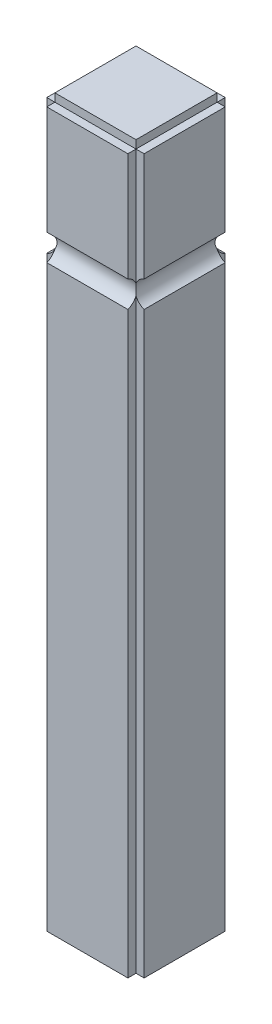
ISO-10303-21;
HEADER;
FILE_DESCRIPTION(('STEP AP214'),'2;1');
FILE_NAME('part.step','',(''),(''),'','','');
FILE_SCHEMA(('AUTOMOTIVE_DESIGN { 1 0 10303 214 1 1 1 1 }'));
ENDSEC;
DATA;
#1=APPLICATION_CONTEXT('core data for automotive mechanical design processes');
#2=APPLICATION_PROTOCOL_DEFINITION('international standard','automotive_design',2000,#1);
#3=PRODUCT_CONTEXT('',#1,'mechanical');
#4=PRODUCT('Part','Part','',(#3));
#5=PRODUCT_RELATED_PRODUCT_CATEGORY('part','',(#4));
#6=PRODUCT_DEFINITION_FORMATION('','',#4);
#7=PRODUCT_DEFINITION_CONTEXT('part definition',#1,'design');
#8=PRODUCT_DEFINITION('design','',#6,#7);
#9=PRODUCT_DEFINITION_SHAPE('','',#8);
#10=(LENGTH_UNIT() NAMED_UNIT(*) SI_UNIT(.MILLI.,.METRE.));
#11=(NAMED_UNIT(*) PLANE_ANGLE_UNIT() SI_UNIT($,.RADIAN.));
#12=(NAMED_UNIT(*) SI_UNIT($,.STERADIAN.) SOLID_ANGLE_UNIT());
#13=UNCERTAINTY_MEASURE_WITH_UNIT(LENGTH_MEASURE(1.E-05),#10,'distance_accuracy_value','');
#14=(GEOMETRIC_REPRESENTATION_CONTEXT(3) GLOBAL_UNCERTAINTY_ASSIGNED_CONTEXT((#13)) GLOBAL_UNIT_ASSIGNED_CONTEXT((#10,
#11,#12)) REPRESENTATION_CONTEXT('',''));
#15=CARTESIAN_POINT('',(0.,0.,0.));
#16=DIRECTION('',(0.,0.,1.));
#17=DIRECTION('',(1.,0.,0.));
#18=AXIS2_PLACEMENT_3D('',#15,#16,#17);
#19=CARTESIAN_POINT('',(0.,0.,0.));
#20=DIRECTION('',(0.,-1.,0.));
#21=DIRECTION('',(0.,0.,-1.));
#22=AXIS2_PLACEMENT_3D('',#19,#20,#21);
#23=PLANE('',#22);
#24=DIRECTION('',(0.,0.,1.));
#25=VECTOR('',#24,1.);
#26=CARTESIAN_POINT('',(15.,0.,-165.));
#27=LINE('',#26,#25);
#28=CARTESIAN_POINT('',(15.,0.,-165.));
#29=VERTEX_POINT('',#28);
#30=CARTESIAN_POINT('',(15.,0.,-15.));
#31=VERTEX_POINT('',#30);
#32=EDGE_CURVE('E243',#29,#31,#27,.T.);
#33=ORIENTED_EDGE('',*,*,#32,.F.);
#34=DIRECTION('',(1.,0.,0.));
#35=VECTOR('',#34,1.);
#36=CARTESIAN_POINT('',(0.,0.,-165.));
#37=LINE('',#36,#35);
#38=CARTESIAN_POINT('',(0.,0.,-165.));
#39=VERTEX_POINT('',#38);
#40=EDGE_CURVE('E390',#39,#29,#37,.T.);
#41=ORIENTED_EDGE('',*,*,#40,.F.);
#42=DIRECTION('',(0.,0.,1.));
#43=VECTOR('',#42,1.);
#44=CARTESIAN_POINT('',(0.,0.,0.));
#45=LINE('',#44,#43);
#46=CARTESIAN_POINT('',(0.,0.,-15.));
#47=VERTEX_POINT('',#46);
#48=EDGE_CURVE('E448',#39,#47,#45,.T.);
#49=ORIENTED_EDGE('',*,*,#48,.T.);
#50=DIRECTION('',(-1.,0.,0.));
#51=VECTOR('',#50,1.);
#52=CARTESIAN_POINT('',(0.,0.,-15.));
#53=LINE('',#52,#51);
#54=EDGE_CURVE('E373',#31,#47,#53,.T.);
#55=ORIENTED_EDGE('',*,*,#54,.F.);
#56=EDGE_LOOP('',(#33,#41,#49,#55));
#57=FACE_BOUND('',#56,.T.);
#58=ADVANCED_FACE('F39',(#57),#23,.F.);
#59=DIRECTION('',(-1.,0.,0.));
#60=VECTOR('',#59,1.);
#61=CARTESIAN_POINT('',(165.,0.,-165.));
#62=LINE('',#61,#60);
#63=CARTESIAN_POINT('',(165.,0.,-165.));
#64=VERTEX_POINT('',#63);
#65=EDGE_CURVE('E240',#64,#29,#62,.T.);
#66=ORIENTED_EDGE('',*,*,#65,.F.);
#67=DIRECTION('',(0.,0.,1.));
#68=VECTOR('',#67,1.);
#69=CARTESIAN_POINT('',(165.,0.,-180.));
#70=LINE('',#69,#68);
#71=CARTESIAN_POINT('',(165.,0.,-180.));
#72=VERTEX_POINT('',#71);
#73=EDGE_CURVE('E357',#72,#64,#70,.T.);
#74=ORIENTED_EDGE('',*,*,#73,.F.);
#75=DIRECTION('',(-1.,0.,0.));
#76=VECTOR('',#75,1.);
#77=CARTESIAN_POINT('',(0.,0.,-180.));
#78=LINE('',#77,#76);
#79=CARTESIAN_POINT('',(15.,0.,-180.));
#80=VERTEX_POINT('',#79);
#81=EDGE_CURVE('E464',#72,#80,#78,.T.);
#82=ORIENTED_EDGE('',*,*,#81,.T.);
#83=DIRECTION('',(0.,0.,-1.));
#84=VECTOR('',#83,1.);
#85=CARTESIAN_POINT('',(15.,0.,-180.));
#86=LINE('',#85,#84);
#87=EDGE_CURVE('E433',#29,#80,#86,.T.);
#88=ORIENTED_EDGE('',*,*,#87,.F.);
#89=EDGE_LOOP('',(#66,#74,#82,#88));
#90=FACE_BOUND('',#89,.T.);
#91=ADVANCED_FACE('F596',(#90),#23,.F.);
#92=DIRECTION('',(0.,0.,-1.));
#93=VECTOR('',#92,1.);
#94=CARTESIAN_POINT('',(165.,0.,-15.));
#95=LINE('',#94,#93);
#96=CARTESIAN_POINT('',(165.,0.,-15.));
#97=VERTEX_POINT('',#96);
#98=EDGE_CURVE('E552',#97,#64,#95,.T.);
#99=ORIENTED_EDGE('',*,*,#98,.F.);
#100=DIRECTION('',(-1.,0.,0.));
#101=VECTOR('',#100,1.);
#102=CARTESIAN_POINT('',(180.,0.,-15.));
#103=LINE('',#102,#101);
#104=CARTESIAN_POINT('',(180.,0.,-15.));
#105=VERTEX_POINT('',#104);
#106=EDGE_CURVE('E347',#105,#97,#103,.T.);
#107=ORIENTED_EDGE('',*,*,#106,.F.);
#108=DIRECTION('',(0.,0.,-1.));
#109=VECTOR('',#108,1.);
#110=CARTESIAN_POINT('',(180.,0.,0.));
#111=LINE('',#110,#109);
#112=CARTESIAN_POINT('',(180.,0.,-165.));
#113=VERTEX_POINT('',#112);
#114=EDGE_CURVE('E483',#105,#113,#111,.T.);
#115=ORIENTED_EDGE('',*,*,#114,.T.);
#116=DIRECTION('',(1.,0.,0.));
#117=VECTOR('',#116,1.);
#118=CARTESIAN_POINT('',(180.,0.,-165.));
#119=LINE('',#118,#117);
#120=EDGE_CURVE('E406',#64,#113,#119,.T.);
#121=ORIENTED_EDGE('',*,*,#120,.F.);
#122=EDGE_LOOP('',(#99,#107,#115,#121));
#123=FACE_BOUND('',#122,.T.);
#124=ADVANCED_FACE('F550',(#123),#23,.F.);
#125=DIRECTION('',(1.,0.,0.));
#126=VECTOR('',#125,1.);
#127=CARTESIAN_POINT('',(15.,0.,-15.));
#128=LINE('',#127,#126);
#129=EDGE_CURVE('E563',#31,#97,#128,.T.);
#130=ORIENTED_EDGE('',*,*,#129,.F.);
#131=DIRECTION('',(0.,0.,-1.));
#132=VECTOR('',#131,1.);
#133=CARTESIAN_POINT('',(15.,0.,0.));
#134=LINE('',#133,#132);
#135=CARTESIAN_POINT('',(15.,0.,0.));
#136=VERTEX_POINT('',#135);
#137=EDGE_CURVE('E378',#136,#31,#134,.T.);
#138=ORIENTED_EDGE('',*,*,#137,.F.);
#139=DIRECTION('',(1.,0.,0.));
#140=VECTOR('',#139,1.);
#141=CARTESIAN_POINT('',(0.,0.,0.));
#142=LINE('',#141,#140);
#143=CARTESIAN_POINT('',(165.,0.,0.));
#144=VERTEX_POINT('',#143);
#145=EDGE_CURVE('E479',#136,#144,#142,.T.);
#146=ORIENTED_EDGE('',*,*,#145,.T.);
#147=DIRECTION('',(0.,0.,1.));
#148=VECTOR('',#147,1.);
#149=CARTESIAN_POINT('',(165.,0.,0.));
#150=LINE('',#149,#148);
#151=EDGE_CURVE('E343',#97,#144,#150,.T.);
#152=ORIENTED_EDGE('',*,*,#151,.F.);
#153=EDGE_LOOP('',(#130,#138,#146,#152));
#154=FACE_BOUND('',#153,.T.);
#155=ADVANCED_FACE('F562',(#154),#23,.F.);
#156=CARTESIAN_POINT('',(0.,-1320.,-180.));
#157=DIRECTION('',(0.,0.,-1.));
#158=DIRECTION('',(-1.,0.,0.));
#159=AXIS2_PLACEMENT_3D('',#156,#157,#158);
#160=PLANE('',#159);
#161=DIRECTION('',(-1.,0.,0.));
#162=VECTOR('',#161,1.);
#163=CARTESIAN_POINT('',(180.,-249.392621835301,-180.));
#164=LINE('',#163,#162);
#165=CARTESIAN_POINT('',(165.,-249.392621835301,-180.));
#166=VERTEX_POINT('',#165);
#167=CARTESIAN_POINT('',(15.0000000000001,-249.392621835301,-180.));
#168=VERTEX_POINT('',#167);
#169=EDGE_CURVE('E256',#166,#168,#164,.T.);
#170=ORIENTED_EDGE('',*,*,#169,.F.);
#171=DIRECTION('',(0.,1.,0.));
#172=VECTOR('',#171,1.);
#173=CARTESIAN_POINT('',(165.,-1320.,-180.));
#174=LINE('',#173,#172);
#175=CARTESIAN_POINT('',(165.,-1320.,-180.));
#176=VERTEX_POINT('',#175);
#177=EDGE_CURVE('E424',#176,#166,#174,.T.);
#178=ORIENTED_EDGE('',*,*,#177,.F.);
#179=DIRECTION('',(-1.,0.,0.));
#180=VECTOR('',#179,1.);
#181=CARTESIAN_POINT('',(0.,-1320.,-180.));
#182=LINE('',#181,#180);
#183=CARTESIAN_POINT('',(15.,-1320.,-180.));
#184=VERTEX_POINT('',#183);
#185=EDGE_CURVE('E472',#176,#184,#182,.T.);
#186=ORIENTED_EDGE('',*,*,#185,.T.);
#187=DIRECTION('',(0.,1.,0.));
#188=VECTOR('',#187,1.);
#189=CARTESIAN_POINT('',(15.,-1320.,-180.));
#190=LINE('',#189,#188);
#191=EDGE_CURVE('E444',#184,#168,#190,.T.);
#192=ORIENTED_EDGE('',*,*,#191,.T.);
#193=EDGE_LOOP('',(#170,#178,#186,#192));
#194=FACE_BOUND('',#193,.T.);
#195=ADVANCED_FACE('F606',(#194),#160,.T.);
#196=CARTESIAN_POINT('',(0.,-1320.,0.));
#197=DIRECTION('',(0.,0.,1.));
#198=DIRECTION('',(1.,0.,0.));
#199=AXIS2_PLACEMENT_3D('',#196,#197,#198);
#200=PLANE('',#199);
#201=DIRECTION('',(-1.,0.,0.));
#202=VECTOR('',#201,1.);
#203=CARTESIAN_POINT('',(180.,-200.607378164699,0.));
#204=LINE('',#203,#202);
#205=CARTESIAN_POINT('',(165.,-200.607378164699,0.));
#206=VERTEX_POINT('',#205);
#207=CARTESIAN_POINT('',(15.,-200.607378164699,0.));
#208=VERTEX_POINT('',#207);
#209=EDGE_CURVE('E250',#206,#208,#204,.T.);
#210=ORIENTED_EDGE('',*,*,#209,.F.);
#211=DIRECTION('',(0.,1.,0.));
#212=VECTOR('',#211,1.);
#213=CARTESIAN_POINT('',(165.,-1320.,0.));
#214=LINE('',#213,#212);
#215=EDGE_CURVE('E358',#206,#144,#214,.T.);
#216=ORIENTED_EDGE('',*,*,#215,.T.);
#217=ORIENTED_EDGE('',*,*,#145,.F.);
#218=DIRECTION('',(0.,1.,0.));
#219=VECTOR('',#218,1.);
#220=CARTESIAN_POINT('',(15.,-1320.,0.));
#221=LINE('',#220,#219);
#222=EDGE_CURVE('E377',#208,#136,#221,.T.);
#223=ORIENTED_EDGE('',*,*,#222,.F.);
#224=EDGE_LOOP('',(#210,#216,#217,#223));
#225=FACE_BOUND('',#224,.T.);
#226=ADVANCED_FACE('F559',(#225),#200,.T.);
#227=CARTESIAN_POINT('',(0.,-1320.,0.));
#228=DIRECTION('',(-1.,0.,0.));
#229=DIRECTION('',(0.,0.,1.));
#230=AXIS2_PLACEMENT_3D('',#227,#228,#229);
#231=PLANE('',#230);
#232=DIRECTION('',(0.,0.,1.));
#233=VECTOR('',#232,1.);
#234=CARTESIAN_POINT('',(0.,-249.392621835301,-180.));
#235=LINE('',#234,#233);
#236=CARTESIAN_POINT('',(0.,-249.392621835301,-165.));
#237=VERTEX_POINT('',#236);
#238=CARTESIAN_POINT('',(0.,-249.392621835301,-15.0000000000001));
#239=VERTEX_POINT('',#238);
#240=EDGE_CURVE('E309',#237,#239,#235,.T.);
#241=ORIENTED_EDGE('',*,*,#240,.F.);
#242=DIRECTION('',(0.,1.,0.));
#243=VECTOR('',#242,1.);
#244=CARTESIAN_POINT('',(0.,-1320.,-165.));
#245=LINE('',#244,#243);
#246=CARTESIAN_POINT('',(0.,-1320.,-165.));
#247=VERTEX_POINT('',#246);
#248=EDGE_CURVE('E455',#247,#237,#245,.T.);
#249=ORIENTED_EDGE('',*,*,#248,.F.);
#250=DIRECTION('',(0.,0.,1.));
#251=VECTOR('',#250,1.);
#252=CARTESIAN_POINT('',(0.,-1320.,0.));
#253=LINE('',#252,#251);
#254=CARTESIAN_POINT('',(0.,-1320.,-15.));
#255=VERTEX_POINT('',#254);
#256=EDGE_CURVE('E459',#247,#255,#253,.T.);
#257=ORIENTED_EDGE('',*,*,#256,.T.);
#258=DIRECTION('',(0.,1.,0.));
#259=VECTOR('',#258,1.);
#260=CARTESIAN_POINT('',(0.,-1320.,-15.));
#261=LINE('',#260,#259);
#262=EDGE_CURVE('E386',#255,#239,#261,.T.);
#263=ORIENTED_EDGE('',*,*,#262,.T.);
#264=EDGE_LOOP('',(#241,#249,#257,#263));
#265=FACE_BOUND('',#264,.T.);
#266=ADVANCED_FACE('F796',(#265),#231,.T.);
#267=CARTESIAN_POINT('',(180.,-1320.,0.));
#268=DIRECTION('',(1.,0.,0.));
#269=DIRECTION('',(0.,0.,-1.));
#270=AXIS2_PLACEMENT_3D('',#267,#268,#269);
#271=PLANE('',#270);
#272=DIRECTION('',(0.,0.,1.));
#273=VECTOR('',#272,1.);
#274=CARTESIAN_POINT('',(180.,-200.607378164699,-180.));
#275=LINE('',#274,#273);
#276=CARTESIAN_POINT('',(180.,-200.607378164699,-165.));
#277=VERTEX_POINT('',#276);
#278=CARTESIAN_POINT('',(180.,-200.607378164699,-15.));
#279=VERTEX_POINT('',#278);
#280=EDGE_CURVE('E310',#277,#279,#275,.T.);
#281=ORIENTED_EDGE('',*,*,#280,.F.);
#282=DIRECTION('',(0.,1.,0.));
#283=VECTOR('',#282,1.);
#284=CARTESIAN_POINT('',(180.,-1320.,-165.));
#285=LINE('',#284,#283);
#286=EDGE_CURVE('E418',#277,#113,#285,.T.);
#287=ORIENTED_EDGE('',*,*,#286,.T.);
#288=ORIENTED_EDGE('',*,*,#114,.F.);
#289=DIRECTION('',(0.,1.,0.));
#290=VECTOR('',#289,1.);
#291=CARTESIAN_POINT('',(180.,-1320.,-15.));
#292=LINE('',#291,#290);
#293=EDGE_CURVE('E63',#279,#105,#292,.T.);
#294=ORIENTED_EDGE('',*,*,#293,.F.);
#295=EDGE_LOOP('',(#281,#287,#288,#294));
#296=FACE_BOUND('',#295,.T.);
#297=ADVANCED_FACE('F545',(#296),#271,.T.);
#298=CARTESIAN_POINT('',(15.,-1320.,-180.));
#299=DIRECTION('',(1.,0.,0.));
#300=DIRECTION('',(0.,0.,-1.));
#301=AXIS2_PLACEMENT_3D('',#298,#299,#300);
#302=PLANE('',#301);
#303=CARTESIAN_POINT('',(15.0000000000001,-200.607378164699,-180.));
#304=VERTEX_POINT('',#303);
#305=EDGE_CURVE('E449',#304,#80,#190,.T.);
#306=ORIENTED_EDGE('',*,*,#305,.F.);
#307=CARTESIAN_POINT('',(15.,-225.,-189.));
#308=DIRECTION('',(1.,0.,0.));
#309=DIRECTION('',(0.,0.,-1.));
#310=AXIS2_PLACEMENT_3D('',#307,#308,#309);
#311=CIRCLE('',#310,26.);
#312=CARTESIAN_POINT('',(15.,-215.,-165.));
#313=VERTEX_POINT('',#312);
#314=EDGE_CURVE('E300',#304,#313,#311,.T.);
#315=ORIENTED_EDGE('',*,*,#314,.T.);
#316=DIRECTION('',(0.,1.,0.));
#317=VECTOR('',#316,1.);
#318=CARTESIAN_POINT('',(15.,-1320.,-165.));
#319=LINE('',#318,#317);
#320=EDGE_CURVE('E454',#313,#29,#319,.T.);
#321=ORIENTED_EDGE('',*,*,#320,.T.);
#322=ORIENTED_EDGE('',*,*,#87,.T.);
#323=EDGE_LOOP('',(#306,#315,#321,#322));
#324=FACE_BOUND('',#323,.T.);
#325=ADVANCED_FACE('F736',(#324),#302,.F.);
#326=CARTESIAN_POINT('',(0.,-1320.,-165.));
#327=DIRECTION('',(0.,0.,1.));
#328=DIRECTION('',(1.,0.,0.));
#329=AXIS2_PLACEMENT_3D('',#326,#327,#328);
#330=PLANE('',#329);
#331=ORIENTED_EDGE('',*,*,#320,.F.);
#332=CARTESIAN_POINT('',(-9.,-225.,-165.));
#333=DIRECTION('',(0.,0.,1.));
#334=DIRECTION('',(1.,0.,0.));
#335=AXIS2_PLACEMENT_3D('',#332,#333,#334);
#336=CIRCLE('',#335,26.);
#337=CARTESIAN_POINT('',(0.,-200.607378164699,-165.));
#338=VERTEX_POINT('',#337);
#339=EDGE_CURVE('E327',#313,#338,#336,.T.);
#340=ORIENTED_EDGE('',*,*,#339,.T.);
#341=EDGE_CURVE('E437',#338,#39,#245,.T.);
#342=ORIENTED_EDGE('',*,*,#341,.T.);
#343=ORIENTED_EDGE('',*,*,#40,.T.);
#344=EDGE_LOOP('',(#331,#340,#342,#343));
#345=FACE_BOUND('',#344,.T.);
#346=ADVANCED_FACE('F726',(#345),#330,.F.);
#347=CARTESIAN_POINT('',(165.,-1320.,0.));
#348=DIRECTION('',(-1.,0.,0.));
#349=DIRECTION('',(0.,0.,1.));
#350=AXIS2_PLACEMENT_3D('',#347,#348,#349);
#351=PLANE('',#350);
#352=DIRECTION('',(0.,1.,0.));
#353=VECTOR('',#352,1.);
#354=CARTESIAN_POINT('',(165.,-1320.,-15.));
#355=LINE('',#354,#353);
#356=CARTESIAN_POINT('',(165.,-1320.,-15.));
#357=VERTEX_POINT('',#356);
#358=CARTESIAN_POINT('',(165.,-235.,-15.));
#359=VERTEX_POINT('',#358);
#360=EDGE_CURVE('E359',#357,#359,#355,.T.);
#361=ORIENTED_EDGE('',*,*,#360,.T.);
#362=CARTESIAN_POINT('',(165.,-225.,9.));
#363=DIRECTION('',(-1.,0.,0.));
#364=DIRECTION('',(0.,0.,1.));
#365=AXIS2_PLACEMENT_3D('',#362,#363,#364);
#366=CIRCLE('',#365,26.);
#367=CARTESIAN_POINT('',(165.,-249.392621835301,0.));
#368=VERTEX_POINT('',#367);
#369=EDGE_CURVE('E269',#359,#368,#366,.T.);
#370=ORIENTED_EDGE('',*,*,#369,.T.);
#371=CARTESIAN_POINT('',(165.,-1320.,0.));
#372=VERTEX_POINT('',#371);
#373=EDGE_CURVE('E353',#372,#368,#214,.T.);
#374=ORIENTED_EDGE('',*,*,#373,.F.);
#375=DIRECTION('',(0.,0.,1.));
#376=VECTOR('',#375,1.);
#377=CARTESIAN_POINT('',(165.,-1320.,0.));
#378=LINE('',#377,#376);
#379=EDGE_CURVE('E342',#357,#372,#378,.T.);
#380=ORIENTED_EDGE('',*,*,#379,.F.);
#381=EDGE_LOOP('',(#361,#370,#374,#380));
#382=FACE_BOUND('',#381,.T.);
#383=ADVANCED_FACE('F502',(#382),#351,.F.);
#384=CARTESIAN_POINT('',(180.,-1320.,-15.));
#385=DIRECTION('',(0.,0.,-1.));
#386=DIRECTION('',(-1.,0.,0.));
#387=AXIS2_PLACEMENT_3D('',#384,#385,#386);
#388=PLANE('',#387);
#389=CARTESIAN_POINT('',(165.,-215.,-15.));
#390=VERTEX_POINT('',#389);
#391=EDGE_CURVE('E363',#390,#97,#355,.T.);
#392=ORIENTED_EDGE('',*,*,#391,.F.);
#393=CARTESIAN_POINT('',(189.,-225.,-15.));
#394=DIRECTION('',(0.,0.,-1.));
#395=DIRECTION('',(-1.,0.,0.));
#396=AXIS2_PLACEMENT_3D('',#393,#394,#395);
#397=CIRCLE('',#396,26.);
#398=EDGE_CURVE('E337',#390,#279,#397,.T.);
#399=ORIENTED_EDGE('',*,*,#398,.T.);
#400=ORIENTED_EDGE('',*,*,#293,.T.);
#401=ORIENTED_EDGE('',*,*,#106,.T.);
#402=EDGE_LOOP('',(#392,#399,#400,#401));
#403=FACE_BOUND('',#402,.T.);
#404=ADVANCED_FACE('F541',(#403),#388,.F.);
#405=CARTESIAN_POINT('',(180.,-1320.,-165.));
#406=DIRECTION('',(0.,0.,1.));
#407=DIRECTION('',(1.,0.,0.));
#408=AXIS2_PLACEMENT_3D('',#405,#406,#407);
#409=PLANE('',#408);
#410=ORIENTED_EDGE('',*,*,#286,.F.);
#411=CARTESIAN_POINT('',(189.,-225.,-165.));
#412=DIRECTION('',(0.,0.,1.));
#413=DIRECTION('',(1.,0.,0.));
#414=AXIS2_PLACEMENT_3D('',#411,#412,#413);
#415=CIRCLE('',#414,26.);
#416=CARTESIAN_POINT('',(165.,-215.,-165.));
#417=VERTEX_POINT('',#416);
#418=EDGE_CURVE('E328',#277,#417,#415,.T.);
#419=ORIENTED_EDGE('',*,*,#418,.T.);
#420=DIRECTION('',(0.,1.,0.));
#421=VECTOR('',#420,1.);
#422=CARTESIAN_POINT('',(165.,-1320.,-165.));
#423=LINE('',#422,#421);
#424=EDGE_CURVE('E423',#417,#64,#423,.T.);
#425=ORIENTED_EDGE('',*,*,#424,.T.);
#426=ORIENTED_EDGE('',*,*,#120,.T.);
#427=EDGE_LOOP('',(#410,#419,#425,#426));
#428=FACE_BOUND('',#427,.T.);
#429=ADVANCED_FACE('F698',(#428),#409,.F.);
#430=CARTESIAN_POINT('',(165.,-1320.,-180.));
#431=DIRECTION('',(-1.,0.,0.));
#432=DIRECTION('',(0.,0.,1.));
#433=AXIS2_PLACEMENT_3D('',#430,#431,#432);
#434=PLANE('',#433);
#435=ORIENTED_EDGE('',*,*,#177,.T.);
#436=CARTESIAN_POINT('',(165.,-225.,-189.));
#437=DIRECTION('',(-1.,0.,0.));
#438=DIRECTION('',(0.,0.,1.));
#439=AXIS2_PLACEMENT_3D('',#436,#437,#438);
#440=CIRCLE('',#439,26.);
#441=CARTESIAN_POINT('',(165.,-235.,-165.));
#442=VERTEX_POINT('',#441);
#443=EDGE_CURVE('E288',#166,#442,#440,.T.);
#444=ORIENTED_EDGE('',*,*,#443,.T.);
#445=CARTESIAN_POINT('',(165.,-1320.,-165.));
#446=VERTEX_POINT('',#445);
#447=EDGE_CURVE('E419',#446,#442,#423,.T.);
#448=ORIENTED_EDGE('',*,*,#447,.F.);
#449=DIRECTION('',(0.,0.,1.));
#450=VECTOR('',#449,1.);
#451=CARTESIAN_POINT('',(165.,-1320.,-180.));
#452=LINE('',#451,#450);
#453=EDGE_CURVE('E401',#176,#446,#452,.T.);
#454=ORIENTED_EDGE('',*,*,#453,.F.);
#455=EDGE_LOOP('',(#435,#444,#448,#454));
#456=FACE_BOUND('',#455,.T.);
#457=ADVANCED_FACE('F763',(#456),#434,.F.);
#458=CARTESIAN_POINT('',(0.,-1320.,-15.));
#459=DIRECTION('',(0.,0.,-1.));
#460=DIRECTION('',(-1.,0.,0.));
#461=AXIS2_PLACEMENT_3D('',#458,#459,#460);
#462=PLANE('',#461);
#463=CARTESIAN_POINT('',(0.,-200.607378164699,-15.0000000000001));
#464=VERTEX_POINT('',#463);
#465=EDGE_CURVE('E391',#464,#47,#261,.T.);
#466=ORIENTED_EDGE('',*,*,#465,.F.);
#467=CARTESIAN_POINT('',(-9.,-225.,-15.));
#468=DIRECTION('',(0.,0.,-1.));
#469=DIRECTION('',(-1.,0.,0.));
#470=AXIS2_PLACEMENT_3D('',#467,#468,#469);
#471=CIRCLE('',#470,26.);
#472=CARTESIAN_POINT('',(15.0000000000001,-215.,-15.));
#473=VERTEX_POINT('',#472);
#474=EDGE_CURVE('E322',#464,#473,#471,.T.);
#475=ORIENTED_EDGE('',*,*,#474,.T.);
#476=DIRECTION('',(0.,1.,0.));
#477=VECTOR('',#476,1.);
#478=CARTESIAN_POINT('',(15.,-1320.,-15.));
#479=LINE('',#478,#477);
#480=EDGE_CURVE('E396',#473,#31,#479,.T.);
#481=ORIENTED_EDGE('',*,*,#480,.T.);
#482=ORIENTED_EDGE('',*,*,#54,.T.);
#483=EDGE_LOOP('',(#466,#475,#481,#482));
#484=FACE_BOUND('',#483,.T.);
#485=ADVANCED_FACE('F523',(#484),#462,.F.);
#486=CARTESIAN_POINT('',(15.,-1320.,0.));
#487=DIRECTION('',(1.,0.,0.));
#488=DIRECTION('',(0.,0.,-1.));
#489=AXIS2_PLACEMENT_3D('',#486,#487,#488);
#490=PLANE('',#489);
#491=ORIENTED_EDGE('',*,*,#480,.F.);
#492=CARTESIAN_POINT('',(15.,-225.,9.));
#493=DIRECTION('',(1.,0.,0.));
#494=DIRECTION('',(0.,0.,-1.));
#495=AXIS2_PLACEMENT_3D('',#492,#493,#494);
#496=CIRCLE('',#495,26.);
#497=EDGE_CURVE('E281',#473,#208,#496,.T.);
#498=ORIENTED_EDGE('',*,*,#497,.T.);
#499=ORIENTED_EDGE('',*,*,#222,.T.);
#500=ORIENTED_EDGE('',*,*,#137,.T.);
#501=EDGE_LOOP('',(#491,#498,#499,#500));
#502=FACE_BOUND('',#501,.T.);
#503=ADVANCED_FACE('F526',(#502),#490,.F.);
#504=DIRECTION('',(0.,0.,1.));
#505=VECTOR('',#504,1.);
#506=CARTESIAN_POINT('',(0.,-200.607378164699,-180.));
#507=LINE('',#506,#505);
#508=EDGE_CURVE('E305',#338,#464,#507,.T.);
#509=ORIENTED_EDGE('',*,*,#508,.T.);
#510=ORIENTED_EDGE('',*,*,#465,.T.);
#511=ORIENTED_EDGE('',*,*,#48,.F.);
#512=ORIENTED_EDGE('',*,*,#341,.F.);
#513=EDGE_LOOP('',(#509,#510,#511,#512));
#514=FACE_BOUND('',#513,.T.);
#515=ADVANCED_FACE('F41',(#514),#231,.T.);
#516=DIRECTION('',(-1.,0.,0.));
#517=VECTOR('',#516,1.);
#518=CARTESIAN_POINT('',(180.,-200.607378164699,-180.));
#519=LINE('',#518,#517);
#520=CARTESIAN_POINT('',(165.,-200.607378164699,-180.));
#521=VERTEX_POINT('',#520);
#522=EDGE_CURVE('E260',#521,#304,#519,.T.);
#523=ORIENTED_EDGE('',*,*,#522,.T.);
#524=ORIENTED_EDGE('',*,*,#305,.T.);
#525=ORIENTED_EDGE('',*,*,#81,.F.);
#526=EDGE_CURVE('E55',#521,#72,#174,.T.);
#527=ORIENTED_EDGE('',*,*,#526,.F.);
#528=EDGE_LOOP('',(#523,#524,#525,#527));
#529=FACE_BOUND('',#528,.T.);
#530=ADVANCED_FACE('F612',(#529),#160,.T.);
#531=DIRECTION('',(0.,0.,1.));
#532=VECTOR('',#531,1.);
#533=CARTESIAN_POINT('',(180.,-249.392621835301,-180.));
#534=LINE('',#533,#532);
#535=CARTESIAN_POINT('',(180.,-249.392621835301,-165.));
#536=VERTEX_POINT('',#535);
#537=CARTESIAN_POINT('',(180.,-249.392621835301,-15.));
#538=VERTEX_POINT('',#537);
#539=EDGE_CURVE('E304',#536,#538,#534,.T.);
#540=ORIENTED_EDGE('',*,*,#539,.T.);
#541=CARTESIAN_POINT('',(180.,-1320.,-15.));
#542=VERTEX_POINT('',#541);
#543=EDGE_CURVE('E364',#542,#538,#292,.T.);
#544=ORIENTED_EDGE('',*,*,#543,.F.);
#545=DIRECTION('',(0.,0.,-1.));
#546=VECTOR('',#545,1.);
#547=CARTESIAN_POINT('',(180.,-1320.,0.));
#548=LINE('',#547,#546);
#549=CARTESIAN_POINT('',(180.,-1320.,-165.));
#550=VERTEX_POINT('',#549);
#551=EDGE_CURVE('E468',#542,#550,#548,.T.);
#552=ORIENTED_EDGE('',*,*,#551,.T.);
#553=EDGE_CURVE('E382',#550,#536,#285,.T.);
#554=ORIENTED_EDGE('',*,*,#553,.T.);
#555=EDGE_LOOP('',(#540,#544,#552,#554));
#556=FACE_BOUND('',#555,.T.);
#557=ADVANCED_FACE('F508',(#556),#271,.T.);
#558=DIRECTION('',(-1.,0.,0.));
#559=VECTOR('',#558,1.);
#560=CARTESIAN_POINT('',(180.,-249.392621835301,0.));
#561=LINE('',#560,#559);
#562=CARTESIAN_POINT('',(15.,-249.392621835301,0.));
#563=VERTEX_POINT('',#562);
#564=EDGE_CURVE('E245',#368,#563,#561,.T.);
#565=ORIENTED_EDGE('',*,*,#564,.T.);
#566=CARTESIAN_POINT('',(15.,-1320.,0.));
#567=VERTEX_POINT('',#566);
#568=EDGE_CURVE('E397',#567,#563,#221,.T.);
#569=ORIENTED_EDGE('',*,*,#568,.F.);
#570=DIRECTION('',(1.,0.,0.));
#571=VECTOR('',#570,1.);
#572=CARTESIAN_POINT('',(0.,-1320.,0.));
#573=LINE('',#572,#571);
#574=EDGE_CURVE('E463',#567,#372,#573,.T.);
#575=ORIENTED_EDGE('',*,*,#574,.T.);
#576=ORIENTED_EDGE('',*,*,#373,.T.);
#577=EDGE_LOOP('',(#565,#569,#575,#576));
#578=FACE_BOUND('',#577,.T.);
#579=ADVANCED_FACE('F742',(#578),#200,.T.);
#580=CARTESIAN_POINT('',(0.,-1320.,0.));
#581=DIRECTION('',(0.,-1.,0.));
#582=DIRECTION('',(0.,0.,-1.));
#583=AXIS2_PLACEMENT_3D('',#580,#581,#582);
#584=PLANE('',#583);
#585=DIRECTION('',(-1.,0.,0.));
#586=VECTOR('',#585,1.);
#587=CARTESIAN_POINT('',(0.,-1320.,-15.));
#588=LINE('',#587,#586);
#589=CARTESIAN_POINT('',(15.,-1320.,-15.));
#590=VERTEX_POINT('',#589);
#591=EDGE_CURVE('E372',#590,#255,#588,.T.);
#592=ORIENTED_EDGE('',*,*,#591,.T.);
#593=ORIENTED_EDGE('',*,*,#256,.F.);
#594=DIRECTION('',(1.,0.,0.));
#595=VECTOR('',#594,1.);
#596=CARTESIAN_POINT('',(0.,-1320.,-165.));
#597=LINE('',#596,#595);
#598=CARTESIAN_POINT('',(15.,-1320.,-165.));
#599=VERTEX_POINT('',#598);
#600=EDGE_CURVE('E428',#247,#599,#597,.T.);
#601=ORIENTED_EDGE('',*,*,#600,.T.);
#602=DIRECTION('',(0.,0.,-1.));
#603=VECTOR('',#602,1.);
#604=CARTESIAN_POINT('',(15.,-1320.,-180.));
#605=LINE('',#604,#603);
#606=EDGE_CURVE('E432',#599,#184,#605,.T.);
#607=ORIENTED_EDGE('',*,*,#606,.T.);
#608=ORIENTED_EDGE('',*,*,#185,.F.);
#609=ORIENTED_EDGE('',*,*,#453,.T.);
#610=DIRECTION('',(1.,0.,0.));
#611=VECTOR('',#610,1.);
#612=CARTESIAN_POINT('',(180.,-1320.,-165.));
#613=LINE('',#612,#611);
#614=EDGE_CURVE('E405',#446,#550,#613,.T.);
#615=ORIENTED_EDGE('',*,*,#614,.T.);
#616=ORIENTED_EDGE('',*,*,#551,.F.);
#617=DIRECTION('',(-1.,0.,0.));
#618=VECTOR('',#617,1.);
#619=CARTESIAN_POINT('',(180.,-1320.,-15.));
#620=LINE('',#619,#618);
#621=EDGE_CURVE('E338',#542,#357,#620,.T.);
#622=ORIENTED_EDGE('',*,*,#621,.T.);
#623=ORIENTED_EDGE('',*,*,#379,.T.);
#624=ORIENTED_EDGE('',*,*,#574,.F.);
#625=DIRECTION('',(0.,0.,-1.));
#626=VECTOR('',#625,1.);
#627=CARTESIAN_POINT('',(15.,-1320.,0.));
#628=LINE('',#627,#626);
#629=EDGE_CURVE('E368',#567,#590,#628,.T.);
#630=ORIENTED_EDGE('',*,*,#629,.T.);
#631=EDGE_LOOP('',(#592,#593,#601,#607,#608,#609,#615,#616,#622,#623,#624,#630));
#632=FACE_BOUND('',#631,.T.);
#633=ADVANCED_FACE('F506',(#632),#584,.T.);
#634=CARTESIAN_POINT('',(15.0000000000001,-235.,-165.));
#635=VERTEX_POINT('',#634);
#636=EDGE_CURVE('E450',#599,#635,#319,.T.);
#637=ORIENTED_EDGE('',*,*,#636,.T.);
#638=CARTESIAN_POINT('',(15.,-225.,-189.));
#639=DIRECTION('',(1.,0.,0.));
#640=DIRECTION('',(0.,0.,-1.));
#641=AXIS2_PLACEMENT_3D('',#638,#639,#640);
#642=CIRCLE('',#641,26.);
#643=EDGE_CURVE('E296',#635,#168,#642,.T.);
#644=ORIENTED_EDGE('',*,*,#643,.T.);
#645=ORIENTED_EDGE('',*,*,#191,.F.);
#646=ORIENTED_EDGE('',*,*,#606,.F.);
#647=EDGE_LOOP('',(#637,#644,#645,#646));
#648=FACE_BOUND('',#647,.T.);
#649=ADVANCED_FACE('F723',(#648),#302,.F.);
#650=ORIENTED_EDGE('',*,*,#248,.T.);
#651=EDGE_CURVE('E323',#237,#635,#336,.T.);
#652=ORIENTED_EDGE('',*,*,#651,.T.);
#653=ORIENTED_EDGE('',*,*,#636,.F.);
#654=ORIENTED_EDGE('',*,*,#600,.F.);
#655=EDGE_LOOP('',(#650,#652,#653,#654));
#656=FACE_BOUND('',#655,.T.);
#657=ADVANCED_FACE('F714',(#656),#330,.F.);
#658=ORIENTED_EDGE('',*,*,#215,.F.);
#659=CARTESIAN_POINT('',(165.,-225.,9.));
#660=DIRECTION('',(-1.,0.,0.));
#661=DIRECTION('',(0.,0.,1.));
#662=AXIS2_PLACEMENT_3D('',#659,#660,#661);
#663=CIRCLE('',#662,26.);
#664=EDGE_CURVE('E259',#206,#390,#663,.T.);
#665=ORIENTED_EDGE('',*,*,#664,.T.);
#666=ORIENTED_EDGE('',*,*,#391,.T.);
#667=ORIENTED_EDGE('',*,*,#151,.T.);
#668=EDGE_LOOP('',(#658,#665,#666,#667));
#669=FACE_BOUND('',#668,.T.);
#670=ADVANCED_FACE('F555',(#669),#351,.F.);
#671=ORIENTED_EDGE('',*,*,#543,.T.);
#672=EDGE_CURVE('E333',#538,#359,#397,.T.);
#673=ORIENTED_EDGE('',*,*,#672,.T.);
#674=ORIENTED_EDGE('',*,*,#360,.F.);
#675=ORIENTED_EDGE('',*,*,#621,.F.);
#676=EDGE_LOOP('',(#671,#673,#674,#675));
#677=FACE_BOUND('',#676,.T.);
#678=ADVANCED_FACE('F498',(#677),#388,.F.);
#679=ORIENTED_EDGE('',*,*,#447,.T.);
#680=EDGE_CURVE('E332',#442,#536,#415,.T.);
#681=ORIENTED_EDGE('',*,*,#680,.T.);
#682=ORIENTED_EDGE('',*,*,#553,.F.);
#683=ORIENTED_EDGE('',*,*,#614,.F.);
#684=EDGE_LOOP('',(#679,#681,#682,#683));
#685=FACE_BOUND('',#684,.T.);
#686=ADVANCED_FACE('F511',(#685),#409,.F.);
#687=ORIENTED_EDGE('',*,*,#424,.F.);
#688=CARTESIAN_POINT('',(165.,-225.,-189.));
#689=DIRECTION('',(-1.,0.,0.));
#690=DIRECTION('',(0.,0.,1.));
#691=AXIS2_PLACEMENT_3D('',#688,#689,#690);
#692=CIRCLE('',#691,26.);
#693=EDGE_CURVE('E285',#417,#521,#692,.T.);
#694=ORIENTED_EDGE('',*,*,#693,.T.);
#695=ORIENTED_EDGE('',*,*,#526,.T.);
#696=ORIENTED_EDGE('',*,*,#73,.T.);
#697=EDGE_LOOP('',(#687,#694,#695,#696));
#698=FACE_BOUND('',#697,.T.);
#699=ADVANCED_FACE('F685',(#698),#434,.F.);
#700=CARTESIAN_POINT('',(15.,-235.,-14.9999999999999));
#701=VERTEX_POINT('',#700);
#702=EDGE_CURVE('E392',#590,#701,#479,.T.);
#703=ORIENTED_EDGE('',*,*,#702,.T.);
#704=EDGE_CURVE('E313',#701,#239,#471,.T.);
#705=ORIENTED_EDGE('',*,*,#704,.T.);
#706=ORIENTED_EDGE('',*,*,#262,.F.);
#707=ORIENTED_EDGE('',*,*,#591,.F.);
#708=EDGE_LOOP('',(#703,#705,#706,#707));
#709=FACE_BOUND('',#708,.T.);
#710=ADVANCED_FACE('F674',(#709),#462,.F.);
#711=ORIENTED_EDGE('',*,*,#568,.T.);
#712=CARTESIAN_POINT('',(15.,-225.,9.));
#713=DIRECTION('',(1.,0.,0.));
#714=DIRECTION('',(0.,0.,-1.));
#715=AXIS2_PLACEMENT_3D('',#712,#713,#714);
#716=CIRCLE('',#715,26.);
#717=EDGE_CURVE('E277',#563,#701,#716,.T.);
#718=ORIENTED_EDGE('',*,*,#717,.T.);
#719=ORIENTED_EDGE('',*,*,#702,.F.);
#720=ORIENTED_EDGE('',*,*,#629,.F.);
#721=EDGE_LOOP('',(#711,#718,#719,#720));
#722=FACE_BOUND('',#721,.T.);
#723=ADVANCED_FACE('F664',(#722),#490,.F.);
#724=CARTESIAN_POINT('',(-9.,-225.,-180.));
#725=DIRECTION('',(0.,0.,1.));
#726=DIRECTION('',(1.,0.,0.));
#727=AXIS2_PLACEMENT_3D('',#724,#725,#726);
#728=CYLINDRICAL_SURFACE('',#727,26.);
#729=ORIENTED_EDGE('',*,*,#339,.F.);
#730=CARTESIAN_POINT('',(-8.99999999999998,-225.,-189.));
#731=DIRECTION('',(-0.707106781186547,0.,0.707106781186547));
#732=DIRECTION('',(0.707106781186547,0.,0.707106781186547));
#733=AXIS2_PLACEMENT_3D('',#730,#731,#732);
#734=ELLIPSE('',#733,36.7695526217005,26.);
#735=EDGE_CURVE('E292',#313,#635,#734,.F.);
#736=ORIENTED_EDGE('',*,*,#735,.T.);
#737=ORIENTED_EDGE('',*,*,#651,.F.);
#738=ORIENTED_EDGE('',*,*,#240,.T.);
#739=ORIENTED_EDGE('',*,*,#704,.F.);
#740=CARTESIAN_POINT('',(-8.99999999999998,-225.,9.00000000000002));
#741=DIRECTION('',(0.707106781186547,0.,0.707106781186547));
#742=DIRECTION('',(-0.707106781186547,0.,0.707106781186547));
#743=AXIS2_PLACEMENT_3D('',#740,#741,#742);
#744=ELLIPSE('',#743,36.7695526217005,26.);
#745=EDGE_CURVE('E273',#701,#473,#744,.T.);
#746=ORIENTED_EDGE('',*,*,#745,.T.);
#747=ORIENTED_EDGE('',*,*,#474,.F.);
#748=ORIENTED_EDGE('',*,*,#508,.F.);
#749=EDGE_LOOP('',(#729,#736,#737,#738,#739,#746,#747,#748));
#750=FACE_BOUND('',#749,.T.);
#751=ADVANCED_FACE('F654',(#750),#728,.F.);
#752=CARTESIAN_POINT('',(189.,-225.,-180.));
#753=DIRECTION('',(0.,0.,1.));
#754=DIRECTION('',(1.,0.,0.));
#755=AXIS2_PLACEMENT_3D('',#752,#753,#754);
#756=CYLINDRICAL_SURFACE('',#755,26.);
#757=ORIENTED_EDGE('',*,*,#680,.F.);
#758=CARTESIAN_POINT('',(189.,-225.,-189.));
#759=DIRECTION('',(0.707106781186547,0.,0.707106781186547));
#760=DIRECTION('',(-0.707106781186547,0.,0.707106781186547));
#761=AXIS2_PLACEMENT_3D('',#758,#759,#760);
#762=ELLIPSE('',#761,36.7695526217005,26.);
#763=EDGE_CURVE('E11',#442,#417,#762,.F.);
#764=ORIENTED_EDGE('',*,*,#763,.T.);
#765=ORIENTED_EDGE('',*,*,#418,.F.);
#766=ORIENTED_EDGE('',*,*,#280,.T.);
#767=ORIENTED_EDGE('',*,*,#398,.F.);
#768=CARTESIAN_POINT('',(189.,-225.,9.00000000000002));
#769=DIRECTION('',(-0.707106781186547,0.,0.707106781186547));
#770=DIRECTION('',(0.707106781186547,0.,0.707106781186547));
#771=AXIS2_PLACEMENT_3D('',#768,#769,#770);
#772=ELLIPSE('',#771,36.7695526217005,26.);
#773=EDGE_CURVE('E48',#390,#359,#772,.T.);
#774=ORIENTED_EDGE('',*,*,#773,.T.);
#775=ORIENTED_EDGE('',*,*,#672,.F.);
#776=ORIENTED_EDGE('',*,*,#539,.F.);
#777=EDGE_LOOP('',(#757,#764,#765,#766,#767,#774,#775,#776));
#778=FACE_BOUND('',#777,.T.);
#779=ADVANCED_FACE('F494',(#778),#756,.F.);
#780=CARTESIAN_POINT('',(180.,-225.,9.));
#781=DIRECTION('',(-1.,0.,0.));
#782=DIRECTION('',(0.,0.,1.));
#783=AXIS2_PLACEMENT_3D('',#780,#781,#782);
#784=CYLINDRICAL_SURFACE('',#783,26.);
#785=ORIENTED_EDGE('',*,*,#745,.F.);
#786=ORIENTED_EDGE('',*,*,#717,.F.);
#787=ORIENTED_EDGE('',*,*,#564,.F.);
#788=ORIENTED_EDGE('',*,*,#369,.F.);
#789=ORIENTED_EDGE('',*,*,#773,.F.);
#790=ORIENTED_EDGE('',*,*,#664,.F.);
#791=ORIENTED_EDGE('',*,*,#209,.T.);
#792=ORIENTED_EDGE('',*,*,#497,.F.);
#793=EDGE_LOOP('',(#785,#786,#787,#788,#789,#790,#791,#792));
#794=FACE_BOUND('',#793,.T.);
#795=ADVANCED_FACE('F557',(#794),#784,.F.);
#796=CARTESIAN_POINT('',(180.,-225.,-189.));
#797=DIRECTION('',(-1.,0.,0.));
#798=DIRECTION('',(0.,0.,1.));
#799=AXIS2_PLACEMENT_3D('',#796,#797,#798);
#800=CYLINDRICAL_SURFACE('',#799,26.);
#801=ORIENTED_EDGE('',*,*,#522,.F.);
#802=ORIENTED_EDGE('',*,*,#693,.F.);
#803=ORIENTED_EDGE('',*,*,#763,.F.);
#804=ORIENTED_EDGE('',*,*,#443,.F.);
#805=ORIENTED_EDGE('',*,*,#169,.T.);
#806=ORIENTED_EDGE('',*,*,#643,.F.);
#807=ORIENTED_EDGE('',*,*,#735,.F.);
#808=ORIENTED_EDGE('',*,*,#314,.F.);
#809=EDGE_LOOP('',(#801,#802,#803,#804,#805,#806,#807,#808));
#810=FACE_BOUND('',#809,.T.);
#811=ADVANCED_FACE('F629',(#810),#800,.F.);
#812=CARTESIAN_POINT('',(15.,15.,-165.));
#813=DIRECTION('',(1.,0.,0.));
#814=DIRECTION('',(0.,0.,-1.));
#815=AXIS2_PLACEMENT_3D('',#812,#813,#814);
#816=PLANE('',#815);
#817=ORIENTED_EDGE('',*,*,#32,.T.);
#818=DIRECTION('',(0.,-1.,0.));
#819=VECTOR('',#818,1.);
#820=CARTESIAN_POINT('',(15.,15.,-15.));
#821=LINE('',#820,#819);
#822=CARTESIAN_POINT('',(15.,15.,-15.));
#823=VERTEX_POINT('',#822);
#824=EDGE_CURVE('E222',#823,#31,#821,.T.);
#825=ORIENTED_EDGE('',*,*,#824,.F.);
#826=DIRECTION('',(0.,0.,1.));
#827=VECTOR('',#826,1.);
#828=CARTESIAN_POINT('',(15.,15.,-165.));
#829=LINE('',#828,#827);
#830=CARTESIAN_POINT('',(15.,15.,-165.));
#831=VERTEX_POINT('',#830);
#832=EDGE_CURVE('E230',#831,#823,#829,.T.);
#833=ORIENTED_EDGE('',*,*,#832,.F.);
#834=DIRECTION('',(0.,-1.,0.));
#835=VECTOR('',#834,1.);
#836=CARTESIAN_POINT('',(15.,15.,-165.));
#837=LINE('',#836,#835);
#838=EDGE_CURVE('E575',#831,#29,#837,.T.);
#839=ORIENTED_EDGE('',*,*,#838,.T.);
#840=EDGE_LOOP('',(#817,#825,#833,#839));
#841=FACE_BOUND('',#840,.T.);
#842=ADVANCED_FACE('F242',(#841),#816,.F.);
#843=CARTESIAN_POINT('',(15.,15.,-15.));
#844=DIRECTION('',(0.,0.,-1.));
#845=DIRECTION('',(-1.,0.,0.));
#846=AXIS2_PLACEMENT_3D('',#843,#844,#845);
#847=PLANE('',#846);
#848=ORIENTED_EDGE('',*,*,#129,.T.);
#849=DIRECTION('',(0.,-1.,0.));
#850=VECTOR('',#849,1.);
#851=CARTESIAN_POINT('',(165.,15.,-15.));
#852=LINE('',#851,#850);
#853=CARTESIAN_POINT('',(165.,15.,-15.));
#854=VERTEX_POINT('',#853);
#855=EDGE_CURVE('E225',#854,#97,#852,.T.);
#856=ORIENTED_EDGE('',*,*,#855,.F.);
#857=DIRECTION('',(1.,0.,0.));
#858=VECTOR('',#857,1.);
#859=CARTESIAN_POINT('',(15.,15.,-15.));
#860=LINE('',#859,#858);
#861=EDGE_CURVE('E217',#823,#854,#860,.T.);
#862=ORIENTED_EDGE('',*,*,#861,.F.);
#863=ORIENTED_EDGE('',*,*,#824,.T.);
#864=EDGE_LOOP('',(#848,#856,#862,#863));
#865=FACE_BOUND('',#864,.T.);
#866=ADVANCED_FACE('F220',(#865),#847,.F.);
#867=CARTESIAN_POINT('',(165.,15.,-15.));
#868=DIRECTION('',(-1.,0.,0.));
#869=DIRECTION('',(0.,0.,1.));
#870=AXIS2_PLACEMENT_3D('',#867,#868,#869);
#871=PLANE('',#870);
#872=ORIENTED_EDGE('',*,*,#98,.T.);
#873=DIRECTION('',(0.,-1.,0.));
#874=VECTOR('',#873,1.);
#875=CARTESIAN_POINT('',(165.,15.,-165.));
#876=LINE('',#875,#874);
#877=CARTESIAN_POINT('',(165.,15.,-165.));
#878=VERTEX_POINT('',#877);
#879=EDGE_CURVE('E252',#878,#64,#876,.T.);
#880=ORIENTED_EDGE('',*,*,#879,.F.);
#881=DIRECTION('',(0.,0.,-1.));
#882=VECTOR('',#881,1.);
#883=CARTESIAN_POINT('',(165.,15.,-15.));
#884=LINE('',#883,#882);
#885=EDGE_CURVE('E229',#854,#878,#884,.T.);
#886=ORIENTED_EDGE('',*,*,#885,.F.);
#887=ORIENTED_EDGE('',*,*,#855,.T.);
#888=EDGE_LOOP('',(#872,#880,#886,#887));
#889=FACE_BOUND('',#888,.T.);
#890=ADVANCED_FACE('F583',(#889),#871,.F.);
#891=CARTESIAN_POINT('',(165.,15.,-165.));
#892=DIRECTION('',(0.,0.,1.));
#893=DIRECTION('',(1.,0.,0.));
#894=AXIS2_PLACEMENT_3D('',#891,#892,#893);
#895=PLANE('',#894);
#896=ORIENTED_EDGE('',*,*,#65,.T.);
#897=ORIENTED_EDGE('',*,*,#838,.F.);
#898=DIRECTION('',(-1.,0.,0.));
#899=VECTOR('',#898,1.);
#900=CARTESIAN_POINT('',(165.,15.,-165.));
#901=LINE('',#900,#899);
#902=EDGE_CURVE('E235',#878,#831,#901,.T.);
#903=ORIENTED_EDGE('',*,*,#902,.F.);
#904=ORIENTED_EDGE('',*,*,#879,.T.);
#905=EDGE_LOOP('',(#896,#897,#903,#904));
#906=FACE_BOUND('',#905,.T.);
#907=ADVANCED_FACE('F581',(#906),#895,.F.);
#908=CARTESIAN_POINT('',(0.,15.,0.));
#909=DIRECTION('',(0.,1.,0.));
#910=DIRECTION('',(0.,0.,1.));
#911=AXIS2_PLACEMENT_3D('',#908,#909,#910);
#912=PLANE('',#911);
#913=ORIENTED_EDGE('',*,*,#832,.T.);
#914=ORIENTED_EDGE('',*,*,#861,.T.);
#915=ORIENTED_EDGE('',*,*,#885,.T.);
#916=ORIENTED_EDGE('',*,*,#902,.T.);
#917=EDGE_LOOP('',(#913,#914,#915,#916));
#918=FACE_BOUND('',#917,.T.);
#919=ADVANCED_FACE('F233',(#918),#912,.T.);
#920=CLOSED_SHELL('',(#58,#91,#124,#155,#195,#226,#266,#297,#325,#346,#383,#404,#429,#457,#485,
#503,#515,#530,#557,#579,#633,#649,#657,#670,#678,#686,#699,#710,#723,#751,#779,#795,#811,#842,
#866,#890,#907,#919));
#921=MANIFOLD_SOLID_BREP('B2',#920);
#922=ADVANCED_BREP_SHAPE_REPRESENTATION('',(#18,#921),#14);
#923=SHAPE_DEFINITION_REPRESENTATION(#9,#922);
ENDSEC;
END-ISO-10303-21;
